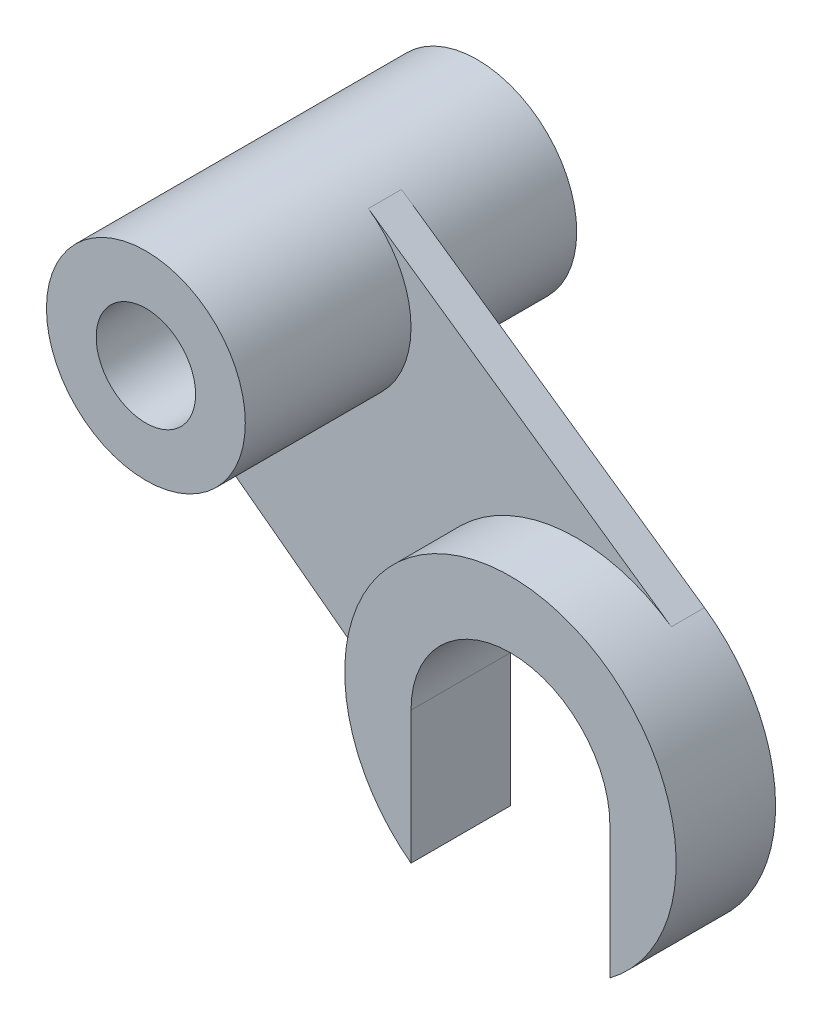
ISO-10303-21;
HEADER;
FILE_DESCRIPTION(('STEP AP214'),'2;1');
FILE_NAME('part.step','',(''),(''),'','','');
FILE_SCHEMA(('AUTOMOTIVE_DESIGN { 1 0 10303 214 1 1 1 1 }'));
ENDSEC;
DATA;
#1=APPLICATION_CONTEXT('core data for automotive mechanical design processes');
#2=APPLICATION_PROTOCOL_DEFINITION('international standard','automotive_design',2000,#1);
#3=PRODUCT_CONTEXT('',#1,'mechanical');
#4=PRODUCT('Part','Part','',(#3));
#5=PRODUCT_RELATED_PRODUCT_CATEGORY('part','',(#4));
#6=PRODUCT_DEFINITION_FORMATION('','',#4);
#7=PRODUCT_DEFINITION_CONTEXT('part definition',#1,'design');
#8=PRODUCT_DEFINITION('design','',#6,#7);
#9=PRODUCT_DEFINITION_SHAPE('','',#8);
#10=(LENGTH_UNIT() NAMED_UNIT(*) SI_UNIT(.MILLI.,.METRE.));
#11=(NAMED_UNIT(*) PLANE_ANGLE_UNIT() SI_UNIT($,.RADIAN.));
#12=(NAMED_UNIT(*) SI_UNIT($,.STERADIAN.) SOLID_ANGLE_UNIT());
#13=UNCERTAINTY_MEASURE_WITH_UNIT(LENGTH_MEASURE(1.E-05),#10,'distance_accuracy_value','');
#14=(GEOMETRIC_REPRESENTATION_CONTEXT(3) GLOBAL_UNCERTAINTY_ASSIGNED_CONTEXT((#13)) GLOBAL_UNIT_ASSIGNED_CONTEXT((#10,
#11,#12)) REPRESENTATION_CONTEXT('',''));
#15=CARTESIAN_POINT('',(0.,0.,0.));
#16=DIRECTION('',(0.,0.,1.));
#17=DIRECTION('',(1.,0.,0.));
#18=AXIS2_PLACEMENT_3D('',#15,#16,#17);
#19=CARTESIAN_POINT('',(0.,0.,-10.));
#20=DIRECTION('',(0.,0.,-1.));
#21=DIRECTION('',(-1.,0.,0.));
#22=AXIS2_PLACEMENT_3D('',#19,#20,#21);
#23=PLANE('',#22);
#24=CARTESIAN_POINT('',(80.,-80.,-10.));
#25=DIRECTION('',(0.,0.,-1.));
#26=DIRECTION('',(1.,0.,0.));
#27=AXIS2_PLACEMENT_3D('',#24,#25,#26);
#28=CIRCLE('',#27,30.);
#29=CARTESIAN_POINT('',(50.,-80.,-10.));
#30=VERTEX_POINT('',#29);
#31=CARTESIAN_POINT('',(110.,-80.,-10.));
#32=VERTEX_POINT('',#31);
#33=EDGE_CURVE('E383',#30,#32,#28,.T.);
#34=ORIENTED_EDGE('',*,*,#33,.F.);
#35=DIRECTION('',(0.,-1.,0.));
#36=VECTOR('',#35,1.);
#37=CARTESIAN_POINT('',(50.,0.,-10.));
#38=LINE('',#37,#36);
#39=CARTESIAN_POINT('',(50.,-120.,-10.));
#40=VERTEX_POINT('',#39);
#41=EDGE_CURVE('E371',#30,#40,#38,.T.);
#42=ORIENTED_EDGE('',*,*,#41,.T.);
#43=DIRECTION('',(0.8,-0.6,0.));
#44=VECTOR('',#43,1.);
#45=CARTESIAN_POINT('',(-30.,-60.,-10.));
#46=LINE('',#45,#44);
#47=CARTESIAN_POINT('',(-30.,-60.,-10.));
#48=VERTEX_POINT('',#47);
#49=EDGE_CURVE('E145',#48,#40,#46,.T.);
#50=ORIENTED_EDGE('',*,*,#49,.F.);
#51=DIRECTION('',(0.,-1.,0.));
#52=VECTOR('',#51,1.);
#53=CARTESIAN_POINT('',(-30.,0.,-10.));
#54=LINE('',#53,#52);
#55=CARTESIAN_POINT('',(-30.,0.,-10.));
#56=VERTEX_POINT('',#55);
#57=EDGE_CURVE('E155',#56,#48,#54,.T.);
#58=ORIENTED_EDGE('',*,*,#57,.F.);
#59=CARTESIAN_POINT('',(0.,0.,-10.));
#60=DIRECTION('',(0.,0.,-1.));
#61=DIRECTION('',(-1.,0.,0.));
#62=AXIS2_PLACEMENT_3D('',#59,#60,#61);
#63=CIRCLE('',#62,30.);
#64=CARTESIAN_POINT('',(17.1291163606126,24.6291163606126,-10.));
#65=VERTEX_POINT('',#64);
#66=EDGE_CURVE('E67',#56,#65,#63,.F.);
#67=ORIENTED_EDGE('',*,*,#66,.T.);
#68=DIRECTION('',(-0.820970545353753,0.570970545353753,0.));
#69=VECTOR('',#68,1.);
#70=CARTESIAN_POINT('',(17.1291163606126,24.6291163606126,-10.));
#71=LINE('',#70,#69);
#72=CARTESIAN_POINT('',(108.548527267688,-38.9514727323124,-10.));
#73=VERTEX_POINT('',#72);
#74=EDGE_CURVE('E170',#73,#65,#71,.T.);
#75=ORIENTED_EDGE('',*,*,#74,.F.);
#76=CARTESIAN_POINT('',(80.,-80.,-10.));
#77=DIRECTION('',(0.,0.,1.));
#78=DIRECTION('',(1.,0.,0.));
#79=AXIS2_PLACEMENT_3D('',#76,#77,#78);
#80=CIRCLE('',#79,50.);
#81=CARTESIAN_POINT('',(110.,-120.,-10.));
#82=VERTEX_POINT('',#81);
#83=EDGE_CURVE('E390',#82,#73,#80,.T.);
#84=ORIENTED_EDGE('',*,*,#83,.F.);
#85=DIRECTION('',(0.,-1.,0.));
#86=VECTOR('',#85,1.);
#87=CARTESIAN_POINT('',(110.,-80.,-10.));
#88=LINE('',#87,#86);
#89=EDGE_CURVE('E386',#32,#82,#88,.T.);
#90=ORIENTED_EDGE('',*,*,#89,.F.);
#91=EDGE_LOOP('',(#34,#42,#50,#58,#67,#75,#84,#90));
#92=FACE_BOUND('',#91,.T.);
#93=ADVANCED_FACE('F43',(#92),#23,.T.);
#94=CARTESIAN_POINT('',(0.,0.,-50.));
#95=DIRECTION('',(0.,0.,1.));
#96=DIRECTION('',(1.,0.,0.));
#97=AXIS2_PLACEMENT_3D('',#94,#95,#96);
#98=CYLINDRICAL_SURFACE('',#97,30.);
#99=ORIENTED_EDGE('',*,*,#66,.F.);
#100=DIRECTION('',(0.,0.,1.));
#101=VECTOR('',#100,1.);
#102=CARTESIAN_POINT('',(-30.,0.,-10.));
#103=LINE('',#102,#101);
#104=CARTESIAN_POINT('',(-30.,0.,0.));
#105=VERTEX_POINT('',#104);
#106=EDGE_CURVE('E93',#56,#105,#103,.T.);
#107=ORIENTED_EDGE('',*,*,#106,.T.);
#108=CARTESIAN_POINT('',(0.,0.,0.));
#109=DIRECTION('',(0.,0.,-1.));
#110=DIRECTION('',(-1.,0.,0.));
#111=AXIS2_PLACEMENT_3D('',#108,#109,#110);
#112=CIRCLE('',#111,30.);
#113=CARTESIAN_POINT('',(17.1291163606126,24.6291163606126,0.));
#114=VERTEX_POINT('',#113);
#115=EDGE_CURVE('E163',#105,#114,#112,.F.);
#116=ORIENTED_EDGE('',*,*,#115,.T.);
#117=DIRECTION('',(0.,0.,1.));
#118=VECTOR('',#117,1.);
#119=CARTESIAN_POINT('',(17.1291163606126,24.6291163606126,-10.));
#120=LINE('',#119,#118);
#121=EDGE_CURVE('E160',#65,#114,#120,.T.);
#122=ORIENTED_EDGE('',*,*,#121,.F.);
#123=EDGE_LOOP('',(#99,#107,#116,#122));
#124=FACE_BOUND('',#123,.T.);
#125=CARTESIAN_POINT('',(0.,0.,-50.));
#126=DIRECTION('',(0.,0.,1.));
#127=DIRECTION('',(1.,0.,0.));
#128=AXIS2_PLACEMENT_3D('',#125,#126,#127);
#129=CIRCLE('',#128,30.);
#130=CARTESIAN_POINT('',(30.,0.,-50.));
#131=VERTEX_POINT('',#130);
#132=EDGE_CURVE('E52',#131,#131,#129,.T.);
#133=ORIENTED_EDGE('',*,*,#132,.T.);
#134=EDGE_LOOP('',(#133));
#135=FACE_BOUND('',#134,.T.);
#136=CARTESIAN_POINT('',(0.,0.,50.));
#137=DIRECTION('',(0.,0.,1.));
#138=DIRECTION('',(1.,0.,0.));
#139=AXIS2_PLACEMENT_3D('',#136,#137,#138);
#140=CIRCLE('',#139,30.);
#141=CARTESIAN_POINT('',(30.,0.,50.));
#142=VERTEX_POINT('',#141);
#143=EDGE_CURVE('E180',#142,#142,#140,.T.);
#144=ORIENTED_EDGE('',*,*,#143,.F.);
#145=EDGE_LOOP('',(#144));
#146=FACE_BOUND('',#145,.T.);
#147=ADVANCED_FACE('F45',(#124,#135,#146),#98,.T.);
#148=CARTESIAN_POINT('',(0.,0.,-50.));
#149=DIRECTION('',(0.,0.,1.));
#150=DIRECTION('',(1.,0.,0.));
#151=AXIS2_PLACEMENT_3D('',#148,#149,#150);
#152=PLANE('',#151);
#153=CARTESIAN_POINT('',(0.,0.,-50.));
#154=DIRECTION('',(0.,0.,1.));
#155=DIRECTION('',(1.,0.,0.));
#156=AXIS2_PLACEMENT_3D('',#153,#154,#155);
#157=CIRCLE('',#156,15.);
#158=CARTESIAN_POINT('',(15.,0.,-50.));
#159=VERTEX_POINT('',#158);
#160=EDGE_CURVE('E184',#159,#159,#157,.T.);
#161=ORIENTED_EDGE('',*,*,#160,.T.);
#162=EDGE_LOOP('',(#161));
#163=FACE_BOUND('',#162,.T.);
#164=ORIENTED_EDGE('',*,*,#132,.F.);
#165=EDGE_LOOP('',(#164));
#166=FACE_BOUND('',#165,.T.);
#167=ADVANCED_FACE('F193',(#163,#166),#152,.F.);
#168=CARTESIAN_POINT('',(0.,0.,-50.));
#169=DIRECTION('',(0.,0.,1.));
#170=DIRECTION('',(1.,0.,0.));
#171=AXIS2_PLACEMENT_3D('',#168,#169,#170);
#172=CYLINDRICAL_SURFACE('',#171,15.);
#173=ORIENTED_EDGE('',*,*,#160,.F.);
#174=EDGE_LOOP('',(#173));
#175=FACE_BOUND('',#174,.T.);
#176=CARTESIAN_POINT('',(0.,0.,50.));
#177=DIRECTION('',(0.,0.,1.));
#178=DIRECTION('',(1.,0.,0.));
#179=AXIS2_PLACEMENT_3D('',#176,#177,#178);
#180=CIRCLE('',#179,15.);
#181=CARTESIAN_POINT('',(15.,0.,50.));
#182=VERTEX_POINT('',#181);
#183=EDGE_CURVE('E176',#182,#182,#180,.T.);
#184=ORIENTED_EDGE('',*,*,#183,.T.);
#185=EDGE_LOOP('',(#184));
#186=FACE_BOUND('',#185,.T.);
#187=ADVANCED_FACE('F195',(#175,#186),#172,.F.);
#188=CARTESIAN_POINT('',(0.,0.,50.));
#189=DIRECTION('',(0.,0.,1.));
#190=DIRECTION('',(1.,0.,0.));
#191=AXIS2_PLACEMENT_3D('',#188,#189,#190);
#192=PLANE('',#191);
#193=ORIENTED_EDGE('',*,*,#143,.T.);
#194=EDGE_LOOP('',(#193));
#195=FACE_BOUND('',#194,.T.);
#196=ORIENTED_EDGE('',*,*,#183,.F.);
#197=EDGE_LOOP('',(#196));
#198=FACE_BOUND('',#197,.T.);
#199=ADVANCED_FACE('F201',(#195,#198),#192,.T.);
#200=CARTESIAN_POINT('',(17.1291163606126,24.6291163606126,-10.));
#201=DIRECTION('',(0.570970545353753,0.820970545353753,0.));
#202=DIRECTION('',(-0.820970545353753,0.570970545353753,0.));
#203=AXIS2_PLACEMENT_3D('',#200,#201,#202);
#204=PLANE('',#203);
#205=DIRECTION('',(-0.820970545353753,0.570970545353753,0.));
#206=VECTOR('',#205,1.);
#207=CARTESIAN_POINT('',(17.1291163606126,24.6291163606126,0.));
#208=LINE('',#207,#206);
#209=CARTESIAN_POINT('',(108.548527267688,-38.9514727323124,0.));
#210=VERTEX_POINT('',#209);
#211=EDGE_CURVE('E58',#210,#114,#208,.T.);
#212=ORIENTED_EDGE('',*,*,#211,.F.);
#213=DIRECTION('',(0.,0.,1.));
#214=VECTOR('',#213,1.);
#215=CARTESIAN_POINT('',(108.548527267688,-38.9514727323124,-10.));
#216=LINE('',#215,#214);
#217=EDGE_CURVE('E86',#73,#210,#216,.T.);
#218=ORIENTED_EDGE('',*,*,#217,.F.);
#219=ORIENTED_EDGE('',*,*,#74,.T.);
#220=ORIENTED_EDGE('',*,*,#121,.T.);
#221=EDGE_LOOP('',(#212,#218,#219,#220));
#222=FACE_BOUND('',#221,.T.);
#223=ADVANCED_FACE('F216',(#222),#204,.T.);
#224=CARTESIAN_POINT('',(-30.,-60.,-10.));
#225=DIRECTION('',(-0.6,-0.8,0.));
#226=DIRECTION('',(0.8,-0.6,0.));
#227=AXIS2_PLACEMENT_3D('',#224,#225,#226);
#228=PLANE('',#227);
#229=DIRECTION('',(0.8,-0.6,0.));
#230=VECTOR('',#229,1.);
#231=CARTESIAN_POINT('',(-30.,-60.,0.));
#232=LINE('',#231,#230);
#233=CARTESIAN_POINT('',(-30.,-60.,0.));
#234=VERTEX_POINT('',#233);
#235=CARTESIAN_POINT('',(50.,-120.,0.));
#236=VERTEX_POINT('',#235);
#237=EDGE_CURVE('E142',#234,#236,#232,.T.);
#238=ORIENTED_EDGE('',*,*,#237,.F.);
#239=DIRECTION('',(0.,0.,1.));
#240=VECTOR('',#239,1.);
#241=CARTESIAN_POINT('',(-30.,-60.,-10.));
#242=LINE('',#241,#240);
#243=EDGE_CURVE('E147',#48,#234,#242,.T.);
#244=ORIENTED_EDGE('',*,*,#243,.F.);
#245=ORIENTED_EDGE('',*,*,#49,.T.);
#246=DIRECTION('',(0.,0.,1.));
#247=VECTOR('',#246,1.);
#248=CARTESIAN_POINT('',(50.,-120.,-10.));
#249=LINE('',#248,#247);
#250=EDGE_CURVE('E130',#40,#236,#249,.T.);
#251=ORIENTED_EDGE('',*,*,#250,.T.);
#252=EDGE_LOOP('',(#238,#244,#245,#251));
#253=FACE_BOUND('',#252,.T.);
#254=ADVANCED_FACE('F141',(#253),#228,.T.);
#255=CARTESIAN_POINT('',(-30.,0.,-10.));
#256=DIRECTION('',(-1.,0.,0.));
#257=DIRECTION('',(0.,-1.,0.));
#258=AXIS2_PLACEMENT_3D('',#255,#256,#257);
#259=PLANE('',#258);
#260=DIRECTION('',(0.,-1.,0.));
#261=VECTOR('',#260,1.);
#262=CARTESIAN_POINT('',(-30.,0.,0.));
#263=LINE('',#262,#261);
#264=EDGE_CURVE('E150',#105,#234,#263,.T.);
#265=ORIENTED_EDGE('',*,*,#264,.F.);
#266=ORIENTED_EDGE('',*,*,#106,.F.);
#267=ORIENTED_EDGE('',*,*,#57,.T.);
#268=ORIENTED_EDGE('',*,*,#243,.T.);
#269=EDGE_LOOP('',(#265,#266,#267,#268));
#270=FACE_BOUND('',#269,.T.);
#271=ADVANCED_FACE('F215',(#270),#259,.T.);
#272=CARTESIAN_POINT('',(0.,0.,0.));
#273=DIRECTION('',(0.,0.,-1.));
#274=DIRECTION('',(-1.,0.,0.));
#275=AXIS2_PLACEMENT_3D('',#272,#273,#274);
#276=PLANE('',#275);
#277=ORIENTED_EDGE('',*,*,#237,.T.);
#278=CARTESIAN_POINT('',(80.,-80.,0.));
#279=DIRECTION('',(0.,0.,-1.));
#280=DIRECTION('',(-1.,0.,0.));
#281=AXIS2_PLACEMENT_3D('',#278,#279,#280);
#282=CIRCLE('',#281,50.);
#283=EDGE_CURVE('E11',#236,#210,#282,.T.);
#284=ORIENTED_EDGE('',*,*,#283,.T.);
#285=ORIENTED_EDGE('',*,*,#211,.T.);
#286=ORIENTED_EDGE('',*,*,#115,.F.);
#287=ORIENTED_EDGE('',*,*,#264,.T.);
#288=EDGE_LOOP('',(#277,#284,#285,#286,#287));
#289=FACE_BOUND('',#288,.T.);
#290=ADVANCED_FACE('F149',(#289),#276,.F.);
#291=CARTESIAN_POINT('',(50.,-80.,-10.));
#292=DIRECTION('',(1.,0.,0.));
#293=DIRECTION('',(0.,0.,-1.));
#294=AXIS2_PLACEMENT_3D('',#291,#292,#293);
#295=PLANE('',#294);
#296=DIRECTION('',(0.,0.,1.));
#297=VECTOR('',#296,1.);
#298=CARTESIAN_POINT('',(50.,-120.,-10.));
#299=LINE('',#298,#297);
#300=CARTESIAN_POINT('',(50.,-120.,20.));
#301=VERTEX_POINT('',#300);
#302=EDGE_CURVE('E122',#236,#301,#299,.T.);
#303=ORIENTED_EDGE('',*,*,#302,.F.);
#304=ORIENTED_EDGE('',*,*,#250,.F.);
#305=ORIENTED_EDGE('',*,*,#41,.F.);
#306=DIRECTION('',(0.,0.,1.));
#307=VECTOR('',#306,1.);
#308=CARTESIAN_POINT('',(50.,-80.,-10.));
#309=LINE('',#308,#307);
#310=CARTESIAN_POINT('',(50.,-80.,20.));
#311=VERTEX_POINT('',#310);
#312=EDGE_CURVE('E135',#30,#311,#309,.T.);
#313=ORIENTED_EDGE('',*,*,#312,.T.);
#314=DIRECTION('',(0.,1.,0.));
#315=VECTOR('',#314,1.);
#316=CARTESIAN_POINT('',(50.,-80.,20.));
#317=LINE('',#316,#315);
#318=EDGE_CURVE('E133',#301,#311,#317,.T.);
#319=ORIENTED_EDGE('',*,*,#318,.F.);
#320=EDGE_LOOP('',(#303,#304,#305,#313,#319));
#321=FACE_BOUND('',#320,.T.);
#322=ADVANCED_FACE('F128',(#321),#295,.T.);
#323=CARTESIAN_POINT('',(80.,-80.,-10.));
#324=DIRECTION('',(0.,0.,1.));
#325=DIRECTION('',(1.,0.,0.));
#326=AXIS2_PLACEMENT_3D('',#323,#324,#325);
#327=CYLINDRICAL_SURFACE('',#326,30.);
#328=ORIENTED_EDGE('',*,*,#312,.F.);
#329=ORIENTED_EDGE('',*,*,#33,.T.);
#330=DIRECTION('',(0.,0.,1.));
#331=VECTOR('',#330,1.);
#332=CARTESIAN_POINT('',(110.,-80.,-10.));
#333=LINE('',#332,#331);
#334=CARTESIAN_POINT('',(110.,-80.,20.));
#335=VERTEX_POINT('',#334);
#336=EDGE_CURVE('E393',#32,#335,#333,.T.);
#337=ORIENTED_EDGE('',*,*,#336,.T.);
#338=CARTESIAN_POINT('',(80.,-80.,20.));
#339=DIRECTION('',(0.,0.,-1.));
#340=DIRECTION('',(1.,0.,0.));
#341=AXIS2_PLACEMENT_3D('',#338,#339,#340);
#342=CIRCLE('',#341,30.);
#343=EDGE_CURVE('E366',#311,#335,#342,.T.);
#344=ORIENTED_EDGE('',*,*,#343,.F.);
#345=EDGE_LOOP('',(#328,#329,#337,#344));
#346=FACE_BOUND('',#345,.T.);
#347=ADVANCED_FACE('F211',(#346),#327,.F.);
#348=CARTESIAN_POINT('',(80.,-80.,-10.));
#349=DIRECTION('',(0.,0.,1.));
#350=DIRECTION('',(1.,0.,0.));
#351=AXIS2_PLACEMENT_3D('',#348,#349,#350);
#352=CYLINDRICAL_SURFACE('',#351,50.);
#353=ORIENTED_EDGE('',*,*,#83,.T.);
#354=ORIENTED_EDGE('',*,*,#217,.T.);
#355=ORIENTED_EDGE('',*,*,#283,.F.);
#356=ORIENTED_EDGE('',*,*,#302,.T.);
#357=CARTESIAN_POINT('',(80.,-80.,20.));
#358=DIRECTION('',(0.,0.,1.));
#359=DIRECTION('',(1.,0.,0.));
#360=AXIS2_PLACEMENT_3D('',#357,#358,#359);
#361=CIRCLE('',#360,50.);
#362=CARTESIAN_POINT('',(110.,-120.,20.));
#363=VERTEX_POINT('',#362);
#364=EDGE_CURVE('E375',#363,#301,#361,.T.);
#365=ORIENTED_EDGE('',*,*,#364,.F.);
#366=DIRECTION('',(0.,0.,1.));
#367=VECTOR('',#366,1.);
#368=CARTESIAN_POINT('',(110.,-120.,-10.));
#369=LINE('',#368,#367);
#370=EDGE_CURVE('E136',#82,#363,#369,.T.);
#371=ORIENTED_EDGE('',*,*,#370,.F.);
#372=EDGE_LOOP('',(#353,#354,#355,#356,#365,#371));
#373=FACE_BOUND('',#372,.T.);
#374=ADVANCED_FACE('F120',(#373),#352,.T.);
#375=CARTESIAN_POINT('',(110.,-80.,-10.));
#376=DIRECTION('',(-1.,0.,0.));
#377=DIRECTION('',(0.,-1.,0.));
#378=AXIS2_PLACEMENT_3D('',#375,#376,#377);
#379=PLANE('',#378);
#380=ORIENTED_EDGE('',*,*,#370,.T.);
#381=DIRECTION('',(0.,-1.,0.));
#382=VECTOR('',#381,1.);
#383=CARTESIAN_POINT('',(110.,-80.,20.));
#384=LINE('',#383,#382);
#385=EDGE_CURVE('E368',#335,#363,#384,.T.);
#386=ORIENTED_EDGE('',*,*,#385,.F.);
#387=ORIENTED_EDGE('',*,*,#336,.F.);
#388=ORIENTED_EDGE('',*,*,#89,.T.);
#389=EDGE_LOOP('',(#380,#386,#387,#388));
#390=FACE_BOUND('',#389,.T.);
#391=ADVANCED_FACE('F270',(#390),#379,.T.);
#392=CARTESIAN_POINT('',(80.,-80.,20.));
#393=DIRECTION('',(0.,0.,1.));
#394=DIRECTION('',(1.,0.,0.));
#395=AXIS2_PLACEMENT_3D('',#392,#393,#394);
#396=PLANE('',#395);
#397=ORIENTED_EDGE('',*,*,#343,.T.);
#398=ORIENTED_EDGE('',*,*,#385,.T.);
#399=ORIENTED_EDGE('',*,*,#364,.T.);
#400=ORIENTED_EDGE('',*,*,#318,.T.);
#401=EDGE_LOOP('',(#397,#398,#399,#400));
#402=FACE_BOUND('',#401,.T.);
#403=ADVANCED_FACE('F276',(#402),#396,.T.);
#404=CLOSED_SHELL('',(#93,#147,#167,#187,#199,#223,#254,#271,#290,#322,#347,#374,#391,#403));
#405=MANIFOLD_SOLID_BREP('B2',#404);
#406=ADVANCED_BREP_SHAPE_REPRESENTATION('',(#18,#405),#14);
#407=SHAPE_DEFINITION_REPRESENTATION(#9,#406);
ENDSEC;
END-ISO-10303-21;
